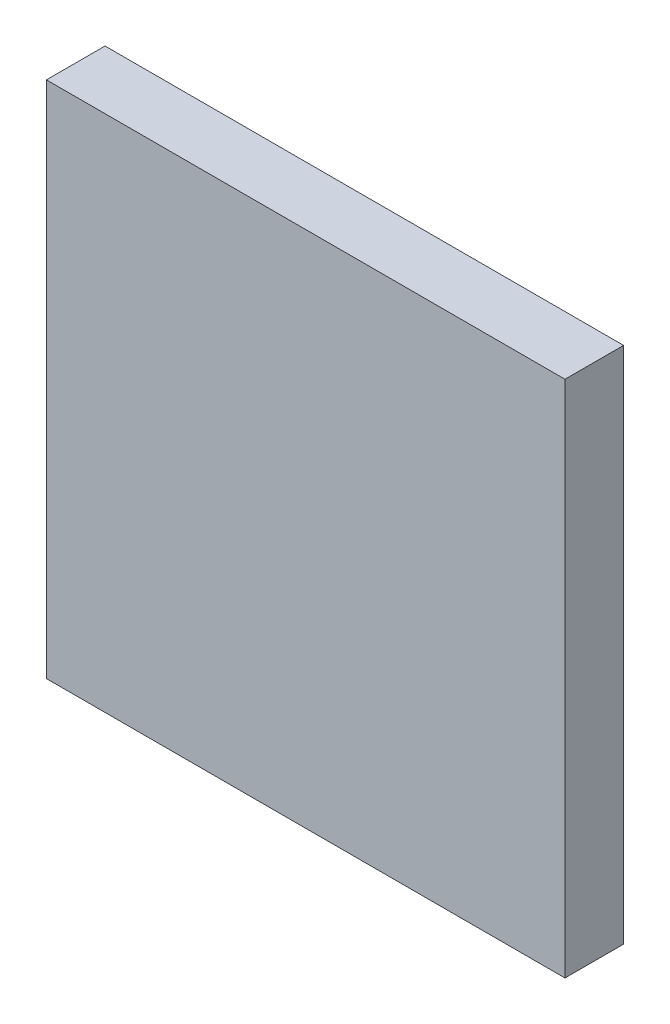
ISO-10303-21;
HEADER;
FILE_DESCRIPTION(('STEP AP214'),'2;1');
FILE_NAME('part.step','',(''),(''),'','','');
FILE_SCHEMA(('AUTOMOTIVE_DESIGN { 1 0 10303 214 1 1 1 1 }'));
ENDSEC;
DATA;
#1=APPLICATION_CONTEXT('core data for automotive mechanical design processes');
#2=APPLICATION_PROTOCOL_DEFINITION('international standard','automotive_design',2000,#1);
#3=PRODUCT_CONTEXT('',#1,'mechanical');
#4=PRODUCT('Part','Part','',(#3));
#5=PRODUCT_RELATED_PRODUCT_CATEGORY('part','',(#4));
#6=PRODUCT_DEFINITION_FORMATION('','',#4);
#7=PRODUCT_DEFINITION_CONTEXT('part definition',#1,'design');
#8=PRODUCT_DEFINITION('design','',#6,#7);
#9=PRODUCT_DEFINITION_SHAPE('','',#8);
#10=(LENGTH_UNIT() NAMED_UNIT(*) SI_UNIT(.MILLI.,.METRE.));
#11=(NAMED_UNIT(*) PLANE_ANGLE_UNIT() SI_UNIT($,.RADIAN.));
#12=(NAMED_UNIT(*) SI_UNIT($,.STERADIAN.) SOLID_ANGLE_UNIT());
#13=UNCERTAINTY_MEASURE_WITH_UNIT(LENGTH_MEASURE(1.E-05),#10,'distance_accuracy_value','');
#14=(GEOMETRIC_REPRESENTATION_CONTEXT(3) GLOBAL_UNCERTAINTY_ASSIGNED_CONTEXT((#13)) GLOBAL_UNIT_ASSIGNED_CONTEXT((#10,
#11,#12)) REPRESENTATION_CONTEXT('',''));
#15=CARTESIAN_POINT('',(0.,0.,0.));
#16=DIRECTION('',(0.,0.,1.));
#17=DIRECTION('',(1.,0.,0.));
#18=AXIS2_PLACEMENT_3D('',#15,#16,#17);
#19=CARTESIAN_POINT('',(0.,0.,2.6));
#20=DIRECTION('',(1.,0.,0.));
#21=DIRECTION('',(0.,1.,0.));
#22=AXIS2_PLACEMENT_3D('',#19,#20,#21);
#23=PLANE('',#22);
#24=DIRECTION('',(0.,-1.,0.));
#25=VECTOR('',#24,1.);
#26=CARTESIAN_POINT('',(0.,0.,0.));
#27=LINE('',#26,#25);
#28=CARTESIAN_POINT('',(0.,0.,0.));
#29=VERTEX_POINT('',#28);
#30=CARTESIAN_POINT('',(0.,-23.,0.));
#31=VERTEX_POINT('',#30);
#32=EDGE_CURVE('E68',#29,#31,#27,.T.);
#33=ORIENTED_EDGE('',*,*,#32,.T.);
#34=DIRECTION('',(0.,0.,-1.));
#35=VECTOR('',#34,1.);
#36=CARTESIAN_POINT('',(0.,-23.,2.6));
#37=LINE('',#36,#35);
#38=CARTESIAN_POINT('',(0.,-23.,2.6));
#39=VERTEX_POINT('',#38);
#40=EDGE_CURVE('E11',#39,#31,#37,.T.);
#41=ORIENTED_EDGE('',*,*,#40,.F.);
#42=DIRECTION('',(0.,-1.,0.));
#43=VECTOR('',#42,1.);
#44=CARTESIAN_POINT('',(0.,0.,2.6));
#45=LINE('',#44,#43);
#46=CARTESIAN_POINT('',(0.,0.,2.6));
#47=VERTEX_POINT('',#46);
#48=EDGE_CURVE('E86',#47,#39,#45,.T.);
#49=ORIENTED_EDGE('',*,*,#48,.F.);
#50=DIRECTION('',(0.,0.,-1.));
#51=VECTOR('',#50,1.);
#52=CARTESIAN_POINT('',(0.,0.,2.6));
#53=LINE('',#52,#51);
#54=EDGE_CURVE('E80',#47,#29,#53,.T.);
#55=ORIENTED_EDGE('',*,*,#54,.T.);
#56=EDGE_LOOP('',(#33,#41,#49,#55));
#57=FACE_BOUND('',#56,.T.);
#58=ADVANCED_FACE('F24',(#57),#23,.F.);
#59=CARTESIAN_POINT('',(0.,-23.,2.6));
#60=DIRECTION('',(0.,1.,0.));
#61=DIRECTION('',(0.,0.,1.));
#62=AXIS2_PLACEMENT_3D('',#59,#60,#61);
#63=PLANE('',#62);
#64=DIRECTION('',(1.,0.,0.));
#65=VECTOR('',#64,1.);
#66=CARTESIAN_POINT('',(0.,-23.,0.));
#67=LINE('',#66,#65);
#68=CARTESIAN_POINT('',(23.,-23.,0.));
#69=VERTEX_POINT('',#68);
#70=EDGE_CURVE('E64',#31,#69,#67,.T.);
#71=ORIENTED_EDGE('',*,*,#70,.T.);
#72=DIRECTION('',(0.,0.,-1.));
#73=VECTOR('',#72,1.);
#74=CARTESIAN_POINT('',(23.,-23.,2.6));
#75=LINE('',#74,#73);
#76=CARTESIAN_POINT('',(23.,-23.,2.6));
#77=VERTEX_POINT('',#76);
#78=EDGE_CURVE('E31',#77,#69,#75,.T.);
#79=ORIENTED_EDGE('',*,*,#78,.F.);
#80=DIRECTION('',(1.,0.,0.));
#81=VECTOR('',#80,1.);
#82=CARTESIAN_POINT('',(0.,-23.,2.6));
#83=LINE('',#82,#81);
#84=EDGE_CURVE('E76',#39,#77,#83,.T.);
#85=ORIENTED_EDGE('',*,*,#84,.F.);
#86=ORIENTED_EDGE('',*,*,#40,.T.);
#87=EDGE_LOOP('',(#71,#79,#85,#86));
#88=FACE_BOUND('',#87,.T.);
#89=ADVANCED_FACE('F75',(#88),#63,.F.);
#90=CARTESIAN_POINT('',(23.,0.,2.6));
#91=DIRECTION('',(-1.,0.,0.));
#92=DIRECTION('',(0.,0.,1.));
#93=AXIS2_PLACEMENT_3D('',#90,#91,#92);
#94=PLANE('',#93);
#95=DIRECTION('',(0.,1.,0.));
#96=VECTOR('',#95,1.);
#97=CARTESIAN_POINT('',(23.,0.,0.));
#98=LINE('',#97,#96);
#99=CARTESIAN_POINT('',(23.,0.,0.));
#100=VERTEX_POINT('',#99);
#101=EDGE_CURVE('E69',#69,#100,#98,.T.);
#102=ORIENTED_EDGE('',*,*,#101,.T.);
#103=DIRECTION('',(0.,0.,-1.));
#104=VECTOR('',#103,1.);
#105=CARTESIAN_POINT('',(23.,0.,2.6));
#106=LINE('',#105,#104);
#107=CARTESIAN_POINT('',(23.,0.,2.6));
#108=VERTEX_POINT('',#107);
#109=EDGE_CURVE('E92',#108,#100,#106,.T.);
#110=ORIENTED_EDGE('',*,*,#109,.F.);
#111=DIRECTION('',(0.,1.,0.));
#112=VECTOR('',#111,1.);
#113=CARTESIAN_POINT('',(23.,0.,2.6));
#114=LINE('',#113,#112);
#115=EDGE_CURVE('E43',#77,#108,#114,.T.);
#116=ORIENTED_EDGE('',*,*,#115,.F.);
#117=ORIENTED_EDGE('',*,*,#78,.T.);
#118=EDGE_LOOP('',(#102,#110,#116,#117));
#119=FACE_BOUND('',#118,.T.);
#120=ADVANCED_FACE('F95',(#119),#94,.F.);
#121=CARTESIAN_POINT('',(0.,0.,2.6));
#122=DIRECTION('',(0.,-1.,0.));
#123=DIRECTION('',(0.,0.,-1.));
#124=AXIS2_PLACEMENT_3D('',#121,#122,#123);
#125=PLANE('',#124);
#126=DIRECTION('',(-1.,0.,0.));
#127=VECTOR('',#126,1.);
#128=CARTESIAN_POINT('',(0.,0.,0.));
#129=LINE('',#128,#127);
#130=EDGE_CURVE('E84',#100,#29,#129,.T.);
#131=ORIENTED_EDGE('',*,*,#130,.T.);
#132=ORIENTED_EDGE('',*,*,#54,.F.);
#133=DIRECTION('',(-1.,0.,0.));
#134=VECTOR('',#133,1.);
#135=CARTESIAN_POINT('',(0.,0.,2.6));
#136=LINE('',#135,#134);
#137=EDGE_CURVE('E38',#108,#47,#136,.T.);
#138=ORIENTED_EDGE('',*,*,#137,.F.);
#139=ORIENTED_EDGE('',*,*,#109,.T.);
#140=EDGE_LOOP('',(#131,#132,#138,#139));
#141=FACE_BOUND('',#140,.T.);
#142=ADVANCED_FACE('F97',(#141),#125,.F.);
#143=CARTESIAN_POINT('',(0.,-23.,2.6));
#144=DIRECTION('',(0.,0.,1.));
#145=DIRECTION('',(1.,0.,0.));
#146=AXIS2_PLACEMENT_3D('',#143,#144,#145);
#147=PLANE('',#146);
#148=ORIENTED_EDGE('',*,*,#48,.T.);
#149=ORIENTED_EDGE('',*,*,#84,.T.);
#150=ORIENTED_EDGE('',*,*,#115,.T.);
#151=ORIENTED_EDGE('',*,*,#137,.T.);
#152=EDGE_LOOP('',(#148,#149,#150,#151));
#153=FACE_BOUND('',#152,.T.);
#154=ADVANCED_FACE('F98',(#153),#147,.T.);
#155=CARTESIAN_POINT('',(0.,-23.,0.));
#156=DIRECTION('',(0.,0.,1.));
#157=DIRECTION('',(1.,0.,0.));
#158=AXIS2_PLACEMENT_3D('',#155,#156,#157);
#159=PLANE('',#158);
#160=ORIENTED_EDGE('',*,*,#32,.F.);
#161=ORIENTED_EDGE('',*,*,#130,.F.);
#162=ORIENTED_EDGE('',*,*,#101,.F.);
#163=ORIENTED_EDGE('',*,*,#70,.F.);
#164=EDGE_LOOP('',(#160,#161,#162,#163));
#165=FACE_BOUND('',#164,.T.);
#166=ADVANCED_FACE('F65',(#165),#159,.F.);
#167=CLOSED_SHELL('',(#58,#89,#120,#142,#154,#166));
#168=MANIFOLD_SOLID_BREP('B2',#167);
#169=ADVANCED_BREP_SHAPE_REPRESENTATION('',(#18,#168),#14);
#170=SHAPE_DEFINITION_REPRESENTATION(#9,#169);
ENDSEC;
END-ISO-10303-21;
